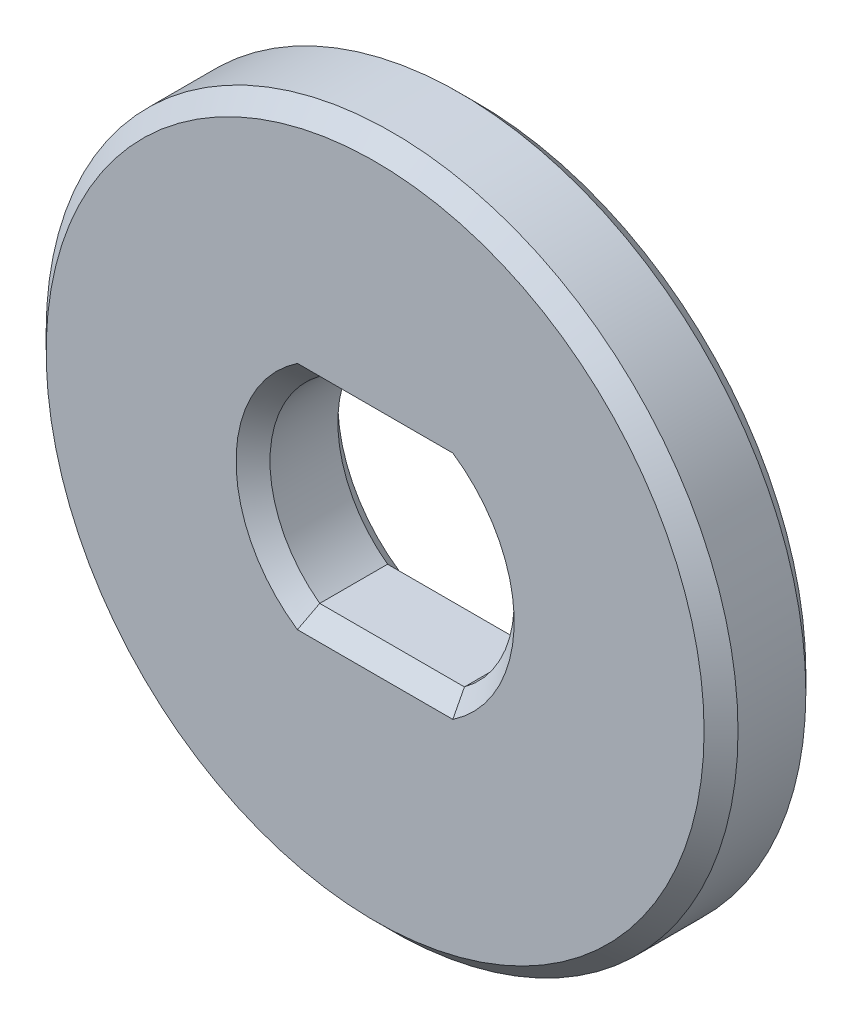
ISO-10303-21;
HEADER;
FILE_DESCRIPTION(('STEP AP214'),'2;1');
FILE_NAME('part.step','',(''),(''),'','','');
FILE_SCHEMA(('AUTOMOTIVE_DESIGN { 1 0 10303 214 1 1 1 1 }'));
ENDSEC;
DATA;
#1=APPLICATION_CONTEXT('core data for automotive mechanical design processes');
#2=APPLICATION_PROTOCOL_DEFINITION('international standard','automotive_design',2000,#1);
#3=PRODUCT_CONTEXT('',#1,'mechanical');
#4=PRODUCT('Part','Part','',(#3));
#5=PRODUCT_RELATED_PRODUCT_CATEGORY('part','',(#4));
#6=PRODUCT_DEFINITION_FORMATION('','',#4);
#7=PRODUCT_DEFINITION_CONTEXT('part definition',#1,'design');
#8=PRODUCT_DEFINITION('design','',#6,#7);
#9=PRODUCT_DEFINITION_SHAPE('','',#8);
#10=(LENGTH_UNIT() NAMED_UNIT(*) SI_UNIT(.MILLI.,.METRE.));
#11=(NAMED_UNIT(*) PLANE_ANGLE_UNIT() SI_UNIT($,.RADIAN.));
#12=(NAMED_UNIT(*) SI_UNIT($,.STERADIAN.) SOLID_ANGLE_UNIT());
#13=UNCERTAINTY_MEASURE_WITH_UNIT(LENGTH_MEASURE(1.E-05),#10,'distance_accuracy_value','');
#14=(GEOMETRIC_REPRESENTATION_CONTEXT(3) GLOBAL_UNCERTAINTY_ASSIGNED_CONTEXT((#13)) GLOBAL_UNIT_ASSIGNED_CONTEXT((#10,
#11,#12)) REPRESENTATION_CONTEXT('',''));
#15=CARTESIAN_POINT('',(0.,0.,0.));
#16=DIRECTION('',(0.,0.,1.));
#17=DIRECTION('',(1.,0.,0.));
#18=AXIS2_PLACEMENT_3D('',#15,#16,#17);
#19=CARTESIAN_POINT('',(0.,0.,3.));
#20=DIRECTION('',(0.,0.,1.));
#21=DIRECTION('',(1.,0.,0.));
#22=AXIS2_PLACEMENT_3D('',#19,#20,#21);
#23=PLANE('',#22);
#24=CARTESIAN_POINT('',(0.,0.,3.));
#25=DIRECTION('',(0.,0.,1.));
#26=DIRECTION('',(1.,0.,0.));
#27=AXIS2_PLACEMENT_3D('',#24,#25,#26);
#28=CIRCLE('',#27,4.1);
#29=CARTESIAN_POINT('',(-2.29128784747792,-3.4,3.));
#30=VERTEX_POINT('',#29);
#31=CARTESIAN_POINT('',(-2.29128784747792,3.4,3.));
#32=VERTEX_POINT('',#31);
#33=EDGE_CURVE('E63',#30,#32,#28,.F.);
#34=ORIENTED_EDGE('',*,*,#33,.T.);
#35=DIRECTION('',(1.,0.,0.));
#36=VECTOR('',#35,1.);
#37=CARTESIAN_POINT('',(0.,3.4,3.));
#38=LINE('',#37,#36);
#39=CARTESIAN_POINT('',(2.29128784747792,3.4,3.));
#40=VERTEX_POINT('',#39);
#41=EDGE_CURVE('E11',#32,#40,#38,.T.);
#42=ORIENTED_EDGE('',*,*,#41,.T.);
#43=CARTESIAN_POINT('',(0.,0.,3.));
#44=DIRECTION('',(0.,0.,1.));
#45=DIRECTION('',(1.,0.,0.));
#46=AXIS2_PLACEMENT_3D('',#43,#44,#45);
#47=CIRCLE('',#46,4.1);
#48=CARTESIAN_POINT('',(2.29128784747792,-3.4,3.));
#49=VERTEX_POINT('',#48);
#50=EDGE_CURVE('E272',#40,#49,#47,.F.);
#51=ORIENTED_EDGE('',*,*,#50,.T.);
#52=DIRECTION('',(-1.,0.,0.));
#53=VECTOR('',#52,1.);
#54=CARTESIAN_POINT('',(0.,-3.4,3.));
#55=LINE('',#54,#53);
#56=EDGE_CURVE('E275',#49,#30,#55,.T.);
#57=ORIENTED_EDGE('',*,*,#56,.T.);
#58=EDGE_LOOP('',(#34,#42,#51,#57));
#59=FACE_BOUND('',#58,.T.);
#60=CARTESIAN_POINT('',(0.,0.,3.));
#61=DIRECTION('',(0.,0.,1.));
#62=DIRECTION('',(1.,0.,0.));
#63=AXIS2_PLACEMENT_3D('',#60,#61,#62);
#64=CIRCLE('',#63,9.7);
#65=CARTESIAN_POINT('',(9.7,0.,3.));
#66=VERTEX_POINT('',#65);
#67=EDGE_CURVE('E278',#66,#66,#64,.T.);
#68=ORIENTED_EDGE('',*,*,#67,.T.);
#69=EDGE_LOOP('',(#68));
#70=FACE_BOUND('',#69,.T.);
#71=ADVANCED_FACE('F47',(#59,#70),#23,.T.);
#72=CARTESIAN_POINT('',(0.,0.,0.));
#73=DIRECTION('',(0.,0.,1.));
#74=DIRECTION('',(1.,0.,0.));
#75=AXIS2_PLACEMENT_3D('',#72,#73,#74);
#76=PLANE('',#75);
#77=DIRECTION('',(1.,0.,0.));
#78=VECTOR('',#77,1.);
#79=CARTESIAN_POINT('',(2.13307290077015,-3.4,0.));
#80=LINE('',#79,#78);
#81=CARTESIAN_POINT('',(-2.29128784747792,-3.4,0.));
#82=VERTEX_POINT('',#81);
#83=CARTESIAN_POINT('',(2.29128784747792,-3.4,0.));
#84=VERTEX_POINT('',#83);
#85=EDGE_CURVE('E133',#82,#84,#80,.T.);
#86=ORIENTED_EDGE('',*,*,#85,.T.);
#87=CARTESIAN_POINT('',(0.,0.,0.));
#88=DIRECTION('',(0.,0.,1.));
#89=DIRECTION('',(1.,0.,0.));
#90=AXIS2_PLACEMENT_3D('',#87,#88,#89);
#91=CIRCLE('',#90,4.1);
#92=CARTESIAN_POINT('',(2.29128784747792,3.4,0.));
#93=VERTEX_POINT('',#92);
#94=EDGE_CURVE('E128',#84,#93,#91,.T.);
#95=ORIENTED_EDGE('',*,*,#94,.T.);
#96=DIRECTION('',(-1.,0.,0.));
#97=VECTOR('',#96,1.);
#98=CARTESIAN_POINT('',(-2.13307290077015,3.4,0.));
#99=LINE('',#98,#97);
#100=CARTESIAN_POINT('',(-2.29128784747792,3.4,0.));
#101=VERTEX_POINT('',#100);
#102=EDGE_CURVE('E121',#93,#101,#99,.T.);
#103=ORIENTED_EDGE('',*,*,#102,.T.);
#104=CARTESIAN_POINT('',(0.,0.,0.));
#105=DIRECTION('',(0.,0.,1.));
#106=DIRECTION('',(1.,0.,0.));
#107=AXIS2_PLACEMENT_3D('',#104,#105,#106);
#108=CIRCLE('',#107,4.1);
#109=EDGE_CURVE('E125',#101,#82,#108,.T.);
#110=ORIENTED_EDGE('',*,*,#109,.T.);
#111=EDGE_LOOP('',(#86,#95,#103,#110));
#112=FACE_BOUND('',#111,.T.);
#113=CARTESIAN_POINT('',(0.,0.,0.));
#114=DIRECTION('',(0.,0.,1.));
#115=DIRECTION('',(1.,0.,0.));
#116=AXIS2_PLACEMENT_3D('',#113,#114,#115);
#117=CIRCLE('',#116,9.69999999999999);
#118=CARTESIAN_POINT('',(9.69999999999999,0.,0.));
#119=VERTEX_POINT('',#118);
#120=EDGE_CURVE('E145',#119,#119,#117,.F.);
#121=ORIENTED_EDGE('',*,*,#120,.T.);
#122=EDGE_LOOP('',(#121));
#123=FACE_BOUND('',#122,.T.);
#124=ADVANCED_FACE('F123',(#112,#123),#76,.F.);
#125=CARTESIAN_POINT('',(0.,0.,3.));
#126=DIRECTION('',(0.,0.,-1.));
#127=DIRECTION('',(-1.,0.,0.));
#128=AXIS2_PLACEMENT_3D('',#125,#126,#127);
#129=CYLINDRICAL_SURFACE('',#128,10.2);
#130=CARTESIAN_POINT('',(0.,0.,0.500000000000004));
#131=DIRECTION('',(0.,0.,1.));
#132=DIRECTION('',(1.,0.,0.));
#133=AXIS2_PLACEMENT_3D('',#130,#131,#132);
#134=CIRCLE('',#133,10.2);
#135=CARTESIAN_POINT('',(10.2,0.,0.500000000000004));
#136=VERTEX_POINT('',#135);
#137=EDGE_CURVE('E282',#136,#136,#134,.T.);
#138=ORIENTED_EDGE('',*,*,#137,.T.);
#139=EDGE_LOOP('',(#138));
#140=FACE_BOUND('',#139,.T.);
#141=CARTESIAN_POINT('',(0.,0.,2.5));
#142=DIRECTION('',(0.,0.,1.));
#143=DIRECTION('',(1.,0.,0.));
#144=AXIS2_PLACEMENT_3D('',#141,#142,#143);
#145=CIRCLE('',#144,10.2);
#146=CARTESIAN_POINT('',(10.2,0.,2.5));
#147=VERTEX_POINT('',#146);
#148=EDGE_CURVE('E286',#147,#147,#145,.F.);
#149=ORIENTED_EDGE('',*,*,#148,.T.);
#150=EDGE_LOOP('',(#149));
#151=FACE_BOUND('',#150,.T.);
#152=ADVANCED_FACE('F249',(#140,#151),#129,.T.);
#153=CARTESIAN_POINT('',(0.,0.,3.));
#154=DIRECTION('',(0.,0.,-1.));
#155=DIRECTION('',(-1.,0.,0.));
#156=AXIS2_PLACEMENT_3D('',#153,#154,#155);
#157=CYLINDRICAL_SURFACE('',#156,3.6);
#158=DIRECTION('',(0.,0.,-1.));
#159=VECTOR('',#158,1.);
#160=CARTESIAN_POINT('',(-2.13307290077015,-2.9,3.));
#161=LINE('',#160,#159);
#162=CARTESIAN_POINT('',(-2.13307290077015,-2.9,2.5));
#163=VERTEX_POINT('',#162);
#164=CARTESIAN_POINT('',(-2.13307290077015,-2.9,0.500000000000004));
#165=VERTEX_POINT('',#164);
#166=EDGE_CURVE('E322',#163,#165,#161,.T.);
#167=ORIENTED_EDGE('',*,*,#166,.T.);
#168=CARTESIAN_POINT('',(0.,0.,0.500000000000004));
#169=DIRECTION('',(0.,0.,1.));
#170=DIRECTION('',(1.,0.,0.));
#171=AXIS2_PLACEMENT_3D('',#168,#169,#170);
#172=CIRCLE('',#171,3.6);
#173=CARTESIAN_POINT('',(-2.13307290077015,2.9,0.500000000000004));
#174=VERTEX_POINT('',#173);
#175=EDGE_CURVE('E290',#165,#174,#172,.F.);
#176=ORIENTED_EDGE('',*,*,#175,.T.);
#177=DIRECTION('',(0.,0.,-1.));
#178=VECTOR('',#177,1.);
#179=CARTESIAN_POINT('',(-2.13307290077015,2.9,3.));
#180=LINE('',#179,#178);
#181=CARTESIAN_POINT('',(-2.13307290077015,2.9,2.5));
#182=VERTEX_POINT('',#181);
#183=EDGE_CURVE('E154',#182,#174,#180,.T.);
#184=ORIENTED_EDGE('',*,*,#183,.F.);
#185=CARTESIAN_POINT('',(0.,0.,2.5));
#186=DIRECTION('',(0.,0.,1.));
#187=DIRECTION('',(1.,0.,0.));
#188=AXIS2_PLACEMENT_3D('',#185,#186,#187);
#189=CIRCLE('',#188,3.6);
#190=EDGE_CURVE('E293',#182,#163,#189,.T.);
#191=ORIENTED_EDGE('',*,*,#190,.T.);
#192=EDGE_LOOP('',(#167,#176,#184,#191));
#193=FACE_BOUND('',#192,.T.);
#194=ADVANCED_FACE('F253',(#193),#157,.F.);
#195=CARTESIAN_POINT('',(-2.13307290077015,-2.9,3.));
#196=DIRECTION('',(0.,1.,0.));
#197=DIRECTION('',(0.,0.,1.));
#198=AXIS2_PLACEMENT_3D('',#195,#196,#197);
#199=PLANE('',#198);
#200=DIRECTION('',(0.,0.,-1.));
#201=VECTOR('',#200,1.);
#202=CARTESIAN_POINT('',(2.13307290077015,-2.9,3.));
#203=LINE('',#202,#201);
#204=CARTESIAN_POINT('',(2.13307290077015,-2.9,2.5));
#205=VERTEX_POINT('',#204);
#206=CARTESIAN_POINT('',(2.13307290077015,-2.9,0.500000000000004));
#207=VERTEX_POINT('',#206);
#208=EDGE_CURVE('E326',#205,#207,#203,.T.);
#209=ORIENTED_EDGE('',*,*,#208,.T.);
#210=DIRECTION('',(-1.,0.,0.));
#211=VECTOR('',#210,1.);
#212=CARTESIAN_POINT('',(-2.13307290077015,-2.9,0.500000000000004));
#213=LINE('',#212,#211);
#214=EDGE_CURVE('E302',#207,#165,#213,.T.);
#215=ORIENTED_EDGE('',*,*,#214,.T.);
#216=ORIENTED_EDGE('',*,*,#166,.F.);
#217=DIRECTION('',(1.,0.,0.));
#218=VECTOR('',#217,1.);
#219=CARTESIAN_POINT('',(-2.13307290077015,-2.9,2.5));
#220=LINE('',#219,#218);
#221=EDGE_CURVE('E305',#163,#205,#220,.T.);
#222=ORIENTED_EDGE('',*,*,#221,.T.);
#223=EDGE_LOOP('',(#209,#215,#216,#222));
#224=FACE_BOUND('',#223,.T.);
#225=ADVANCED_FACE('F351',(#224),#199,.T.);
#226=CARTESIAN_POINT('',(0.,0.,3.));
#227=DIRECTION('',(0.,0.,-1.));
#228=DIRECTION('',(-1.,0.,0.));
#229=AXIS2_PLACEMENT_3D('',#226,#227,#228);
#230=CYLINDRICAL_SURFACE('',#229,3.6);
#231=DIRECTION('',(0.,0.,-1.));
#232=VECTOR('',#231,1.);
#233=CARTESIAN_POINT('',(2.13307290077015,2.9,3.));
#234=LINE('',#233,#232);
#235=CARTESIAN_POINT('',(2.13307290077015,2.9,2.5));
#236=VERTEX_POINT('',#235);
#237=CARTESIAN_POINT('',(2.13307290077015,2.9,0.500000000000004));
#238=VERTEX_POINT('',#237);
#239=EDGE_CURVE('E330',#236,#238,#234,.T.);
#240=ORIENTED_EDGE('',*,*,#239,.T.);
#241=CARTESIAN_POINT('',(0.,0.,0.500000000000004));
#242=DIRECTION('',(0.,0.,1.));
#243=DIRECTION('',(1.,0.,0.));
#244=AXIS2_PLACEMENT_3D('',#241,#242,#243);
#245=CIRCLE('',#244,3.6);
#246=EDGE_CURVE('E308',#238,#207,#245,.F.);
#247=ORIENTED_EDGE('',*,*,#246,.T.);
#248=ORIENTED_EDGE('',*,*,#208,.F.);
#249=CARTESIAN_POINT('',(0.,0.,2.5));
#250=DIRECTION('',(0.,0.,1.));
#251=DIRECTION('',(1.,0.,0.));
#252=AXIS2_PLACEMENT_3D('',#249,#250,#251);
#253=CIRCLE('',#252,3.6);
#254=EDGE_CURVE('E312',#205,#236,#253,.T.);
#255=ORIENTED_EDGE('',*,*,#254,.T.);
#256=EDGE_LOOP('',(#240,#247,#248,#255));
#257=FACE_BOUND('',#256,.T.);
#258=ADVANCED_FACE('F348',(#257),#230,.F.);
#259=CARTESIAN_POINT('',(-2.13307290077015,2.9,3.));
#260=DIRECTION('',(0.,-1.,0.));
#261=DIRECTION('',(0.,0.,-1.));
#262=AXIS2_PLACEMENT_3D('',#259,#260,#261);
#263=PLANE('',#262);
#264=ORIENTED_EDGE('',*,*,#183,.T.);
#265=DIRECTION('',(1.,0.,0.));
#266=VECTOR('',#265,1.);
#267=CARTESIAN_POINT('',(2.13307290077015,2.9,0.500000000000004));
#268=LINE('',#267,#266);
#269=EDGE_CURVE('E148',#174,#238,#268,.T.);
#270=ORIENTED_EDGE('',*,*,#269,.T.);
#271=ORIENTED_EDGE('',*,*,#239,.F.);
#272=DIRECTION('',(-1.,0.,0.));
#273=VECTOR('',#272,1.);
#274=CARTESIAN_POINT('',(-2.13307290077015,2.9,2.5));
#275=LINE('',#274,#273);
#276=EDGE_CURVE('E298',#236,#182,#275,.T.);
#277=ORIENTED_EDGE('',*,*,#276,.T.);
#278=EDGE_LOOP('',(#264,#270,#271,#277));
#279=FACE_BOUND('',#278,.T.);
#280=ADVANCED_FACE('F186',(#279),#263,.T.);
#281=CARTESIAN_POINT('',(0.,0.,0.));
#282=DIRECTION('',(0.,0.,-1.));
#283=DIRECTION('',(-1.,0.,0.));
#284=AXIS2_PLACEMENT_3D('',#281,#282,#283);
#285=CONICAL_SURFACE('',#284,4.1,0.785398163397447);
#286=CARTESIAN_POINT('',(-2.29128784747792,3.4,0.));
#287=CARTESIAN_POINT('',(-2.265816455851,3.31652470912045,0.0834752908795558));
#288=CARTESIAN_POINT('',(-2.23989619399549,3.23312043621899,0.166879563781013));
#289=CARTESIAN_POINT('',(-2.18715788011994,3.06645376928436,0.333546230715643));
#290=CARTESIAN_POINT('',(-2.16033982640762,2.98319137551893,0.41680862448107));
#291=CARTESIAN_POINT('',(-2.1330729007744,2.89999999999935,0.500000000000652));
#292=B_SPLINE_CURVE_WITH_KNOTS('',3,(#286,#287,#288,#289,#290,#291),.UNSPECIFIED.,.F.,.F.,(4,2,
4),(0.,0.362297735377826,0.724596153707433),.UNSPECIFIED.);
#293=EDGE_CURVE('E139',#174,#101,#292,.F.);
#294=ORIENTED_EDGE('',*,*,#293,.F.);
#295=ORIENTED_EDGE('',*,*,#175,.F.);
#296=CARTESIAN_POINT('',(-2.13307290077015,-2.9,0.500000000000004));
#297=CARTESIAN_POINT('',(-2.16033982640549,-2.98319137551925,0.416808624480755));
#298=CARTESIAN_POINT('',(-2.18715788011923,-3.06645376928446,0.333546230715548));
#299=CARTESIAN_POINT('',(-2.23989619399619,-3.23312043621887,0.166879563781134));
#300=CARTESIAN_POINT('',(-2.26581645585171,-3.31652470912033,0.0834752908796728));
#301=CARTESIAN_POINT('',(-2.29128784747792,-3.4,0.));
#302=B_SPLINE_CURVE_WITH_KNOTS('',3,(#296,#297,#298,#299,#300,#301),.UNSPECIFIED.,.F.,.F.,(4,2,
4),(0.,0.36229841832964,0.724596153707481),.UNSPECIFIED.);
#303=EDGE_CURVE('E142',#82,#165,#302,.F.);
#304=ORIENTED_EDGE('',*,*,#303,.F.);
#305=ORIENTED_EDGE('',*,*,#109,.F.);
#306=EDGE_LOOP('',(#294,#295,#304,#305));
#307=FACE_BOUND('',#306,.T.);
#308=ADVANCED_FACE('F137',(#307),#285,.F.);
#309=CARTESIAN_POINT('',(0.,-3.4,0.));
#310=DIRECTION('',(0.,0.707106781186549,-0.707106781186546));
#311=DIRECTION('',(-1.,0.,0.));
#312=AXIS2_PLACEMENT_3D('',#309,#310,#311);
#313=PLANE('',#312);
#314=ORIENTED_EDGE('',*,*,#303,.T.);
#315=ORIENTED_EDGE('',*,*,#214,.F.);
#316=CARTESIAN_POINT('',(2.13307290077015,-2.9,0.500000000000004));
#317=CARTESIAN_POINT('',(2.16033982640549,-2.98319137551925,0.416808624480755));
#318=CARTESIAN_POINT('',(2.18715788011923,-3.06645376928446,0.333546230715548));
#319=CARTESIAN_POINT('',(2.23989619399619,-3.23312043621887,0.166879563781134));
#320=CARTESIAN_POINT('',(2.26581645585171,-3.31652470912033,0.0834752908796729));
#321=CARTESIAN_POINT('',(2.29128784747792,-3.4,0.));
#322=B_SPLINE_CURVE_WITH_KNOTS('',3,(#316,#317,#318,#319,#320,#321),.UNSPECIFIED.,.F.,.F.,(4,2,
4),(0.,0.36229841832964,0.724596153707481),.UNSPECIFIED.);
#323=EDGE_CURVE('E150',#84,#207,#322,.F.);
#324=ORIENTED_EDGE('',*,*,#323,.F.);
#325=ORIENTED_EDGE('',*,*,#85,.F.);
#326=EDGE_LOOP('',(#314,#315,#324,#325));
#327=FACE_BOUND('',#326,.T.);
#328=ADVANCED_FACE('F185',(#327),#313,.T.);
#329=CARTESIAN_POINT('',(0.,3.4,0.));
#330=DIRECTION('',(0.,-0.707106781186549,-0.707106781186546));
#331=DIRECTION('',(1.,0.,0.));
#332=AXIS2_PLACEMENT_3D('',#329,#330,#331);
#333=PLANE('',#332);
#334=ORIENTED_EDGE('',*,*,#293,.T.);
#335=ORIENTED_EDGE('',*,*,#102,.F.);
#336=CARTESIAN_POINT('',(2.29128784747792,3.4,0.));
#337=CARTESIAN_POINT('',(2.265816455851,3.31652470912045,0.0834752908795556));
#338=CARTESIAN_POINT('',(2.23989619399549,3.23312043621899,0.166879563781013));
#339=CARTESIAN_POINT('',(2.18715788011994,3.06645376928436,0.333546230715643));
#340=CARTESIAN_POINT('',(2.16033982640761,2.98319137551893,0.41680862448107));
#341=CARTESIAN_POINT('',(2.1330729007744,2.89999999999935,0.500000000000652));
#342=B_SPLINE_CURVE_WITH_KNOTS('',3,(#336,#337,#338,#339,#340,#341),.UNSPECIFIED.,.F.,.F.,(4,2,
4),(0.,0.362297735377826,0.724596153707433),.UNSPECIFIED.);
#343=EDGE_CURVE('E156',#238,#93,#342,.F.);
#344=ORIENTED_EDGE('',*,*,#343,.F.);
#345=ORIENTED_EDGE('',*,*,#269,.F.);
#346=EDGE_LOOP('',(#334,#335,#344,#345));
#347=FACE_BOUND('',#346,.T.);
#348=ADVANCED_FACE('F147',(#347),#333,.T.);
#349=CARTESIAN_POINT('',(0.,0.,0.));
#350=DIRECTION('',(0.,0.,-1.));
#351=DIRECTION('',(-1.,0.,0.));
#352=AXIS2_PLACEMENT_3D('',#349,#350,#351);
#353=CONICAL_SURFACE('',#352,4.1,0.785398163397447);
#354=ORIENTED_EDGE('',*,*,#323,.T.);
#355=ORIENTED_EDGE('',*,*,#246,.F.);
#356=ORIENTED_EDGE('',*,*,#343,.T.);
#357=ORIENTED_EDGE('',*,*,#94,.F.);
#358=EDGE_LOOP('',(#354,#355,#356,#357));
#359=FACE_BOUND('',#358,.T.);
#360=ADVANCED_FACE('F198',(#359),#353,.F.);
#361=CARTESIAN_POINT('',(0.,0.,0.500000000000004));
#362=DIRECTION('',(0.,0.,1.));
#363=DIRECTION('',(1.,0.,0.));
#364=AXIS2_PLACEMENT_3D('',#361,#362,#363);
#365=CONICAL_SURFACE('',#364,10.2,0.785398163397452);
#366=ORIENTED_EDGE('',*,*,#120,.F.);
#367=EDGE_LOOP('',(#366));
#368=FACE_BOUND('',#367,.T.);
#369=ORIENTED_EDGE('',*,*,#137,.F.);
#370=EDGE_LOOP('',(#369));
#371=FACE_BOUND('',#370,.T.);
#372=ADVANCED_FACE('F189',(#368,#371),#365,.T.);
#373=CARTESIAN_POINT('',(-2.13307290077015,-2.9,2.5));
#374=DIRECTION('',(0.,-0.707106781186547,-0.707106781186547));
#375=DIRECTION('',(1.,0.,0.));
#376=AXIS2_PLACEMENT_3D('',#373,#374,#375);
#377=PLANE('',#376);
#378=CARTESIAN_POINT('',(-2.13307290077015,-2.9,2.5));
#379=CARTESIAN_POINT('',(-2.16033982640549,-2.98319137551925,2.58319137551925));
#380=CARTESIAN_POINT('',(-2.18715788011923,-3.06645376928446,2.66645376928445));
#381=CARTESIAN_POINT('',(-2.23989619399619,-3.23312043621887,2.83312043621887));
#382=CARTESIAN_POINT('',(-2.26581645585171,-3.31652470912033,2.91652470912033));
#383=CARTESIAN_POINT('',(-2.29128784747792,-3.4,3.));
#384=B_SPLINE_CURVE_WITH_KNOTS('',3,(#378,#379,#380,#381,#382,#383),.UNSPECIFIED.,.F.,.F.,(4,2,
4),(0.,0.362298418329638,0.724596153707477),.UNSPECIFIED.);
#385=EDGE_CURVE('E222',#30,#163,#384,.F.);
#386=ORIENTED_EDGE('',*,*,#385,.F.);
#387=ORIENTED_EDGE('',*,*,#56,.F.);
#388=CARTESIAN_POINT('',(2.29128784747792,-3.4,3.));
#389=CARTESIAN_POINT('',(2.265816455851,-3.31652470912045,2.91652470912044));
#390=CARTESIAN_POINT('',(2.23989619399549,-3.23312043621899,2.83312043621899));
#391=CARTESIAN_POINT('',(2.18715788011994,-3.06645376928436,2.66645376928436));
#392=CARTESIAN_POINT('',(2.16033982640762,-2.98319137551893,2.58319137551893));
#393=CARTESIAN_POINT('',(2.1330729007744,-2.89999999999935,2.49999999999935));
#394=B_SPLINE_CURVE_WITH_KNOTS('',3,(#388,#389,#390,#391,#392,#393),.UNSPECIFIED.,.F.,.F.,(4,2,
4),(0.,0.362297735377823,0.724596153707428),.UNSPECIFIED.);
#395=EDGE_CURVE('E52',#205,#49,#394,.F.);
#396=ORIENTED_EDGE('',*,*,#395,.F.);
#397=ORIENTED_EDGE('',*,*,#221,.F.);
#398=EDGE_LOOP('',(#386,#387,#396,#397));
#399=FACE_BOUND('',#398,.T.);
#400=ADVANCED_FACE('F197',(#399),#377,.F.);
#401=CARTESIAN_POINT('',(0.,0.,2.5));
#402=DIRECTION('',(0.,0.,1.));
#403=DIRECTION('',(1.,0.,0.));
#404=AXIS2_PLACEMENT_3D('',#401,#402,#403);
#405=CONICAL_SURFACE('',#404,3.6,0.785398163397449);
#406=ORIENTED_EDGE('',*,*,#395,.T.);
#407=ORIENTED_EDGE('',*,*,#50,.F.);
#408=CARTESIAN_POINT('',(2.29128784747792,3.4,3.));
#409=CARTESIAN_POINT('',(2.265816455851,3.31652470912045,2.91652470912044));
#410=CARTESIAN_POINT('',(2.23989619399549,3.23312043621899,2.83312043621899));
#411=CARTESIAN_POINT('',(2.18715788011994,3.06645376928436,2.66645376928436));
#412=CARTESIAN_POINT('',(2.16033982640761,2.98319137551893,2.58319137551893));
#413=CARTESIAN_POINT('',(2.1330729007744,2.89999999999935,2.49999999999935));
#414=B_SPLINE_CURVE_WITH_KNOTS('',3,(#408,#409,#410,#411,#412,#413),.UNSPECIFIED.,.F.,.F.,(4,2,
4),(0.,0.362297735377824,0.724596153707428),.UNSPECIFIED.);
#415=EDGE_CURVE('E76',#236,#40,#414,.F.);
#416=ORIENTED_EDGE('',*,*,#415,.F.);
#417=ORIENTED_EDGE('',*,*,#254,.F.);
#418=EDGE_LOOP('',(#406,#407,#416,#417));
#419=FACE_BOUND('',#418,.T.);
#420=ADVANCED_FACE('F228',(#419),#405,.F.);
#421=CARTESIAN_POINT('',(0.,0.,2.5));
#422=DIRECTION('',(0.,0.,1.));
#423=DIRECTION('',(1.,0.,0.));
#424=AXIS2_PLACEMENT_3D('',#421,#422,#423);
#425=CONICAL_SURFACE('',#424,3.6,0.785398163397449);
#426=ORIENTED_EDGE('',*,*,#385,.T.);
#427=ORIENTED_EDGE('',*,*,#190,.F.);
#428=CARTESIAN_POINT('',(-2.13307290077015,2.9,2.5));
#429=CARTESIAN_POINT('',(-2.16033982640549,2.98319137551925,2.58319137551925));
#430=CARTESIAN_POINT('',(-2.18715788011923,3.06645376928446,2.66645376928445));
#431=CARTESIAN_POINT('',(-2.23989619399619,3.23312043621887,2.83312043621887));
#432=CARTESIAN_POINT('',(-2.26581645585171,3.31652470912033,2.91652470912033));
#433=CARTESIAN_POINT('',(-2.29128784747792,3.4,3.));
#434=B_SPLINE_CURVE_WITH_KNOTS('',3,(#428,#429,#430,#431,#432,#433),.UNSPECIFIED.,.F.,.F.,(4,2,
4),(0.,0.362298418329638,0.724596153707477),.UNSPECIFIED.);
#435=EDGE_CURVE('E211',#32,#182,#434,.F.);
#436=ORIENTED_EDGE('',*,*,#435,.F.);
#437=ORIENTED_EDGE('',*,*,#33,.F.);
#438=EDGE_LOOP('',(#426,#427,#436,#437));
#439=FACE_BOUND('',#438,.T.);
#440=ADVANCED_FACE('F208',(#439),#425,.F.);
#441=CARTESIAN_POINT('',(-2.13307290077015,2.9,2.5));
#442=DIRECTION('',(0.,0.707106781186547,-0.707106781186547));
#443=DIRECTION('',(-1.,0.,0.));
#444=AXIS2_PLACEMENT_3D('',#441,#442,#443);
#445=PLANE('',#444);
#446=ORIENTED_EDGE('',*,*,#415,.T.);
#447=ORIENTED_EDGE('',*,*,#41,.F.);
#448=ORIENTED_EDGE('',*,*,#435,.T.);
#449=ORIENTED_EDGE('',*,*,#276,.F.);
#450=EDGE_LOOP('',(#446,#447,#448,#449));
#451=FACE_BOUND('',#450,.T.);
#452=ADVANCED_FACE('F201',(#451),#445,.F.);
#453=CARTESIAN_POINT('',(0.,0.,3.));
#454=DIRECTION('',(0.,0.,-1.));
#455=DIRECTION('',(-1.,0.,0.));
#456=AXIS2_PLACEMENT_3D('',#453,#454,#455);
#457=CONICAL_SURFACE('',#456,9.7,0.785398163397447);
#458=ORIENTED_EDGE('',*,*,#148,.F.);
#459=EDGE_LOOP('',(#458));
#460=FACE_BOUND('',#459,.T.);
#461=ORIENTED_EDGE('',*,*,#67,.F.);
#462=EDGE_LOOP('',(#461));
#463=FACE_BOUND('',#462,.T.);
#464=ADVANCED_FACE('F50',(#460,#463),#457,.T.);
#465=CLOSED_SHELL('',(#71,#124,#152,#194,#225,#258,#280,#308,#328,#348,#360,#372,#400,#420,#440,
#452,#464));
#466=MANIFOLD_SOLID_BREP('B2',#465);
#467=ADVANCED_BREP_SHAPE_REPRESENTATION('',(#18,#466),#14);
#468=SHAPE_DEFINITION_REPRESENTATION(#9,#467);
ENDSEC;
END-ISO-10303-21;
